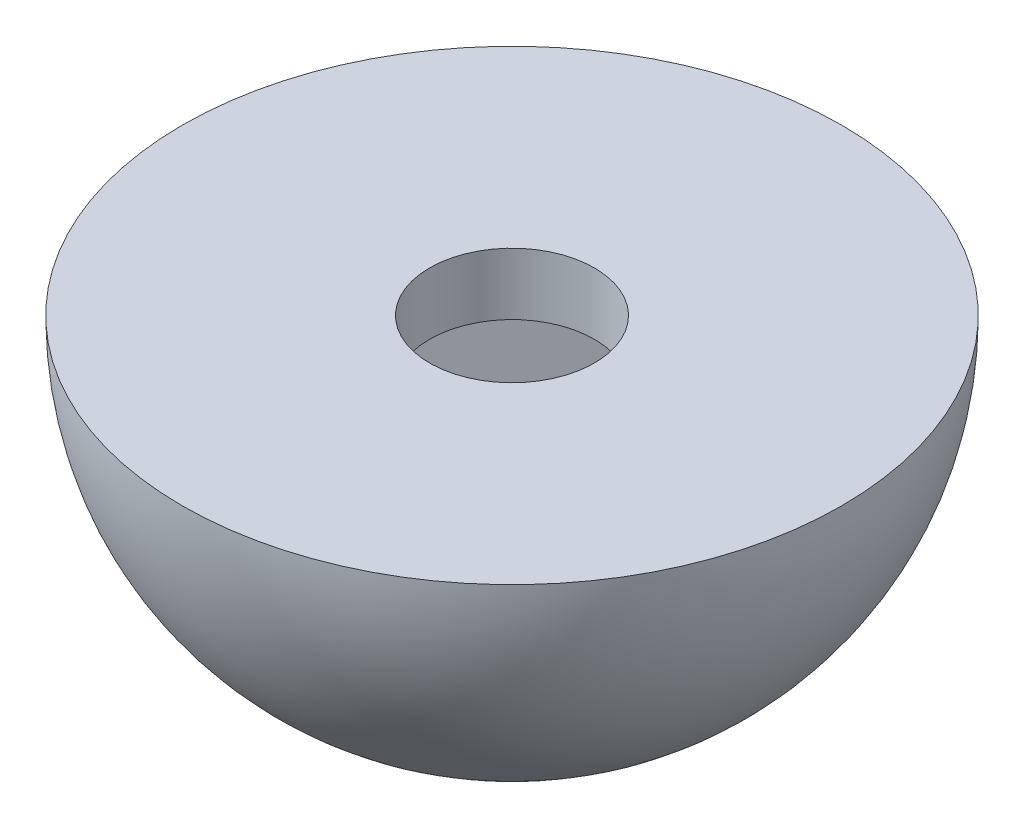
ISO-10303-21;
HEADER;
FILE_DESCRIPTION(('STEP AP214'),'2;1');
FILE_NAME('part.step','',(''),(''),'','','');
FILE_SCHEMA(('AUTOMOTIVE_DESIGN { 1 0 10303 214 1 1 1 1 }'));
ENDSEC;
DATA;
#1=APPLICATION_CONTEXT('core data for automotive mechanical design processes');
#2=APPLICATION_PROTOCOL_DEFINITION('international standard','automotive_design',2000,#1);
#3=PRODUCT_CONTEXT('',#1,'mechanical');
#4=PRODUCT('Part','Part','',(#3));
#5=PRODUCT_RELATED_PRODUCT_CATEGORY('part','',(#4));
#6=PRODUCT_DEFINITION_FORMATION('','',#4);
#7=PRODUCT_DEFINITION_CONTEXT('part definition',#1,'design');
#8=PRODUCT_DEFINITION('design','',#6,#7);
#9=PRODUCT_DEFINITION_SHAPE('','',#8);
#10=(LENGTH_UNIT() NAMED_UNIT(*) SI_UNIT(.MILLI.,.METRE.));
#11=(NAMED_UNIT(*) PLANE_ANGLE_UNIT() SI_UNIT($,.RADIAN.));
#12=(NAMED_UNIT(*) SI_UNIT($,.STERADIAN.) SOLID_ANGLE_UNIT());
#13=UNCERTAINTY_MEASURE_WITH_UNIT(LENGTH_MEASURE(1.E-05),#10,'distance_accuracy_value','');
#14=(GEOMETRIC_REPRESENTATION_CONTEXT(3) GLOBAL_UNCERTAINTY_ASSIGNED_CONTEXT((#13)) GLOBAL_UNIT_ASSIGNED_CONTEXT((#10,
#11,#12)) REPRESENTATION_CONTEXT('',''));
#15=CARTESIAN_POINT('',(0.,0.,0.));
#16=DIRECTION('',(0.,0.,1.));
#17=DIRECTION('',(1.,0.,0.));
#18=AXIS2_PLACEMENT_3D('',#15,#16,#17);
#19=CARTESIAN_POINT('',(0.,0.,0.));
#20=DIRECTION('',(0.,1.,0.));
#21=DIRECTION('',(-1.,0.,0.));
#22=AXIS2_PLACEMENT_3D('',#19,#20,#21);
#23=SPHERICAL_SURFACE('',#22,4.);
#24=CARTESIAN_POINT('',(1.25514625240658,0.,1.57996293787851));
#25=DIRECTION('',(0.622024915621709,0.,0.782997448492525));
#26=DIRECTION('',(0.782997448492526,0.,-0.62202491562171));
#27=AXIS2_PLACEMENT_3D('',#24,#25,#26);
#28=CIRCLE('',#27,3.45374072564806);
#29=CARTESIAN_POINT('',(2.16733827990038,-3.25132280771996,0.855303911179222));
#30=VERTEX_POINT('',#29);
#31=CARTESIAN_POINT('',(0.342954224912791,-3.25132280771996,2.30462196457781));
#32=VERTEX_POINT('',#31);
#33=EDGE_CURVE('E11',#30,#32,#28,.F.);
#34=ORIENTED_EDGE('',*,*,#33,.F.);
#35=CARTESIAN_POINT('',(1.99586116744398,0.,-0.29700707110968));
#36=DIRECTION('',(0.989108139303779,0.,-0.14719065446901));
#37=DIRECTION('',(-0.14719065446901,0.,-0.989108139303779));
#38=AXIS2_PLACEMENT_3D('',#35,#36,#37);
#39=CIRCLE('',#38,3.45374072564806);
#40=CARTESIAN_POINT('',(1.82438405498758,-3.25132280771996,-1.44931805339858));
#41=VERTEX_POINT('',#40);
#42=EDGE_CURVE('E86',#41,#30,#39,.F.);
#43=ORIENTED_EDGE('',*,*,#42,.F.);
#44=CARTESIAN_POINT('',(0.740714915037396,0.,-1.8769700089882));
#45=DIRECTION('',(0.36708322368207,0.,-0.930188102961535));
#46=DIRECTION('',(-0.930188102961535,0.,-0.36708322368207));
#47=AXIS2_PLACEMENT_3D('',#44,#45,#46);
#48=CIRCLE('',#47,3.45374072564806);
#49=CARTESIAN_POINT('',(-0.342954224912791,-3.25132280771996,-2.30462196457781));
#50=VERTEX_POINT('',#49);
#51=EDGE_CURVE('E131',#50,#41,#48,.F.);
#52=ORIENTED_EDGE('',*,*,#51,.F.);
#53=CARTESIAN_POINT('',(-1.25514625240658,0.,-1.57996293787851));
#54=DIRECTION('',(-0.622024915621709,0.,-0.782997448492526));
#55=DIRECTION('',(-0.782997448492526,0.,0.622024915621709));
#56=AXIS2_PLACEMENT_3D('',#53,#54,#55);
#57=CIRCLE('',#56,3.45374072564806);
#58=CARTESIAN_POINT('',(-2.16733827990038,-3.25132280771996,-0.855303911179223));
#59=VERTEX_POINT('',#58);
#60=EDGE_CURVE('E133',#59,#50,#57,.F.);
#61=ORIENTED_EDGE('',*,*,#60,.F.);
#62=CARTESIAN_POINT('',(-1.99586116744398,0.,0.29700707110968));
#63=DIRECTION('',(-0.989108139303779,0.,0.14719065446901));
#64=DIRECTION('',(0.14719065446901,0.,0.989108139303779));
#65=AXIS2_PLACEMENT_3D('',#62,#63,#64);
#66=CIRCLE('',#65,3.45374072564806);
#67=CARTESIAN_POINT('',(-1.82438405498758,-3.25132280771996,1.44931805339858));
#68=VERTEX_POINT('',#67);
#69=EDGE_CURVE('E135',#68,#59,#66,.F.);
#70=ORIENTED_EDGE('',*,*,#69,.F.);
#71=CARTESIAN_POINT('',(-0.740714915037396,0.,1.87697000898819));
#72=DIRECTION('',(-0.36708322368207,0.,0.930188102961535));
#73=DIRECTION('',(0.930188102961535,0.,0.36708322368207));
#74=AXIS2_PLACEMENT_3D('',#71,#72,#73);
#75=CIRCLE('',#74,3.45374072564806);
#76=EDGE_CURVE('E39',#32,#68,#75,.F.);
#77=ORIENTED_EDGE('',*,*,#76,.F.);
#78=EDGE_LOOP('',(#34,#43,#52,#61,#70,#77));
#79=FACE_BOUND('',#78,.T.);
#80=CARTESIAN_POINT('',(0.,0.,0.));
#81=DIRECTION('',(0.,1.,0.));
#82=DIRECTION('',(-1.,0.,0.));
#83=AXIS2_PLACEMENT_3D('',#80,#81,#82);
#84=CIRCLE('',#83,4.);
#85=CARTESIAN_POINT('',(-4.,0.,0.));
#86=VERTEX_POINT('',#85);
#87=EDGE_CURVE('E125',#86,#86,#84,.T.);
#88=ORIENTED_EDGE('',*,*,#87,.F.);
#89=EDGE_LOOP('',(#88));
#90=FACE_BOUND('',#89,.T.);
#91=ADVANCED_FACE('F32',(#79,#90),#23,.T.);
#92=CARTESIAN_POINT('',(-4.,0.,0.));
#93=DIRECTION('',(0.,1.,0.));
#94=DIRECTION('',(-1.,0.,0.));
#95=AXIS2_PLACEMENT_3D('',#92,#93,#94);
#96=PLANE('',#95);
#97=CARTESIAN_POINT('',(0.,0.,0.));
#98=DIRECTION('',(0.,1.,0.));
#99=DIRECTION('',(-1.,0.,0.));
#100=AXIS2_PLACEMENT_3D('',#97,#98,#99);
#101=CIRCLE('',#100,1.);
#102=CARTESIAN_POINT('',(-1.,0.,0.));
#103=VERTEX_POINT('',#102);
#104=EDGE_CURVE('E122',#103,#103,#101,.T.);
#105=ORIENTED_EDGE('',*,*,#104,.F.);
#106=EDGE_LOOP('',(#105));
#107=FACE_BOUND('',#106,.T.);
#108=ORIENTED_EDGE('',*,*,#87,.T.);
#109=EDGE_LOOP('',(#108));
#110=FACE_BOUND('',#109,.T.);
#111=ADVANCED_FACE('F163',(#107,#110),#96,.T.);
#112=CARTESIAN_POINT('',(0.,-4.,0.));
#113=DIRECTION('',(0.,1.,0.));
#114=DIRECTION('',(-1.,0.,0.));
#115=AXIS2_PLACEMENT_3D('',#112,#113,#114);
#116=CYLINDRICAL_SURFACE('',#115,1.);
#117=CARTESIAN_POINT('',(0.,-0.75,0.));
#118=DIRECTION('',(0.,1.,0.));
#119=DIRECTION('',(-1.,0.,0.));
#120=AXIS2_PLACEMENT_3D('',#117,#118,#119);
#121=CIRCLE('',#120,1.);
#122=CARTESIAN_POINT('',(-1.,-0.75,0.));
#123=VERTEX_POINT('',#122);
#124=EDGE_CURVE('E114',#123,#123,#121,.F.);
#125=ORIENTED_EDGE('',*,*,#124,.T.);
#126=EDGE_LOOP('',(#125));
#127=FACE_BOUND('',#126,.T.);
#128=ORIENTED_EDGE('',*,*,#104,.T.);
#129=EDGE_LOOP('',(#128));
#130=FACE_BOUND('',#129,.T.);
#131=ADVANCED_FACE('F167',(#127,#130),#116,.F.);
#132=CARTESIAN_POINT('',(0.,-0.75,0.));
#133=DIRECTION('',(0.,1.,0.));
#134=DIRECTION('',(-1.,0.,0.));
#135=AXIS2_PLACEMENT_3D('',#132,#133,#134);
#136=PLANE('',#135);
#137=DIRECTION('',(0.782997448492525,0.,-0.622024915621709));
#138=VECTOR('',#137,1.);
#139=CARTESIAN_POINT('',(0.342954224912791,-0.75,2.30462196457781));
#140=LINE('',#139,#138);
#141=CARTESIAN_POINT('',(0.342954224912791,-0.75,2.30462196457781));
#142=VERTEX_POINT('',#141);
#143=CARTESIAN_POINT('',(2.16733827990038,-0.75,0.855303911179223));
#144=VERTEX_POINT('',#143);
#145=EDGE_CURVE('E95',#142,#144,#140,.T.);
#146=ORIENTED_EDGE('',*,*,#145,.F.);
#147=DIRECTION('',(0.930188102961535,0.,0.36708322368207));
#148=VECTOR('',#147,1.);
#149=CARTESIAN_POINT('',(-1.82438405498759,-0.750000000000001,1.44931805339858));
#150=LINE('',#149,#148);
#151=CARTESIAN_POINT('',(-1.82438405498759,-0.750000000000001,1.44931805339858));
#152=VERTEX_POINT('',#151);
#153=EDGE_CURVE('E88',#152,#142,#150,.T.);
#154=ORIENTED_EDGE('',*,*,#153,.F.);
#155=DIRECTION('',(0.14719065446901,0.,0.989108139303779));
#156=VECTOR('',#155,1.);
#157=CARTESIAN_POINT('',(-2.16733827990038,-0.750000000000001,-0.855303911179223));
#158=LINE('',#157,#156);
#159=CARTESIAN_POINT('',(-2.16733827990038,-0.750000000000001,-0.855303911179223));
#160=VERTEX_POINT('',#159);
#161=EDGE_CURVE('E109',#160,#152,#158,.T.);
#162=ORIENTED_EDGE('',*,*,#161,.F.);
#163=DIRECTION('',(-0.782997448492526,0.,0.622024915621709));
#164=VECTOR('',#163,1.);
#165=CARTESIAN_POINT('',(-0.342954224912792,-0.75,-2.30462196457781));
#166=LINE('',#165,#164);
#167=CARTESIAN_POINT('',(-0.342954224912792,-0.75,-2.30462196457781));
#168=VERTEX_POINT('',#167);
#169=EDGE_CURVE('E106',#168,#160,#166,.T.);
#170=ORIENTED_EDGE('',*,*,#169,.F.);
#171=DIRECTION('',(-0.930188102961535,0.,-0.36708322368207));
#172=VECTOR('',#171,1.);
#173=CARTESIAN_POINT('',(1.82438405498758,-0.75,-1.44931805339858));
#174=LINE('',#173,#172);
#175=CARTESIAN_POINT('',(1.82438405498758,-0.75,-1.44931805339858));
#176=VERTEX_POINT('',#175);
#177=EDGE_CURVE('E98',#176,#168,#174,.T.);
#178=ORIENTED_EDGE('',*,*,#177,.F.);
#179=DIRECTION('',(-0.14719065446901,0.,-0.989108139303779));
#180=VECTOR('',#179,1.);
#181=CARTESIAN_POINT('',(2.16733827990038,-0.75,0.855303911179223));
#182=LINE('',#181,#180);
#183=EDGE_CURVE('E83',#144,#176,#182,.T.);
#184=ORIENTED_EDGE('',*,*,#183,.F.);
#185=EDGE_LOOP('',(#146,#154,#162,#170,#178,#184));
#186=FACE_BOUND('',#185,.T.);
#187=ORIENTED_EDGE('',*,*,#124,.F.);
#188=EDGE_LOOP('',(#187));
#189=FACE_BOUND('',#188,.T.);
#190=ADVANCED_FACE('F92',(#186,#189),#136,.F.);
#191=CARTESIAN_POINT('',(0.342954224912792,-3.87298334620742,2.30462196457781));
#192=DIRECTION('',(0.622024915621709,0.,0.782997448492525));
#193=DIRECTION('',(0.782997448492526,0.,-0.62202491562171));
#194=AXIS2_PLACEMENT_3D('',#191,#192,#193);
#195=PLANE('',#194);
#196=ORIENTED_EDGE('',*,*,#33,.T.);
#197=DIRECTION('',(0.,1.,0.));
#198=VECTOR('',#197,1.);
#199=CARTESIAN_POINT('',(0.342954224912792,-3.87298334620742,2.30462196457781));
#200=LINE('',#199,#198);
#201=EDGE_CURVE('E101',#32,#142,#200,.T.);
#202=ORIENTED_EDGE('',*,*,#201,.T.);
#203=ORIENTED_EDGE('',*,*,#145,.T.);
#204=DIRECTION('',(0.,1.,0.));
#205=VECTOR('',#204,1.);
#206=CARTESIAN_POINT('',(2.16733827990038,-3.87298334620742,0.855303911179223));
#207=LINE('',#206,#205);
#208=EDGE_CURVE('E80',#30,#144,#207,.T.);
#209=ORIENTED_EDGE('',*,*,#208,.F.);
#210=EDGE_LOOP('',(#196,#202,#203,#209));
#211=FACE_BOUND('',#210,.T.);
#212=ADVANCED_FACE('F100',(#211),#195,.F.);
#213=CARTESIAN_POINT('',(-1.82438405498758,-3.87298334620742,1.44931805339858));
#214=DIRECTION('',(-0.36708322368207,0.,0.930188102961535));
#215=DIRECTION('',(0.930188102961535,0.,0.36708322368207));
#216=AXIS2_PLACEMENT_3D('',#213,#214,#215);
#217=PLANE('',#216);
#218=ORIENTED_EDGE('',*,*,#76,.T.);
#219=DIRECTION('',(0.,1.,0.));
#220=VECTOR('',#219,1.);
#221=CARTESIAN_POINT('',(-1.82438405498758,-3.87298334620742,1.44931805339858));
#222=LINE('',#221,#220);
#223=EDGE_CURVE('E115',#68,#152,#222,.T.);
#224=ORIENTED_EDGE('',*,*,#223,.T.);
#225=ORIENTED_EDGE('',*,*,#153,.T.);
#226=ORIENTED_EDGE('',*,*,#201,.F.);
#227=EDGE_LOOP('',(#218,#224,#225,#226));
#228=FACE_BOUND('',#227,.T.);
#229=ADVANCED_FACE('F139',(#228),#217,.F.);
#230=CARTESIAN_POINT('',(-2.16733827990038,-3.87298334620742,-0.855303911179223));
#231=DIRECTION('',(-0.989108139303779,0.,0.14719065446901));
#232=DIRECTION('',(0.14719065446901,0.,0.989108139303779));
#233=AXIS2_PLACEMENT_3D('',#230,#231,#232);
#234=PLANE('',#233);
#235=ORIENTED_EDGE('',*,*,#69,.T.);
#236=DIRECTION('',(0.,1.,0.));
#237=VECTOR('',#236,1.);
#238=CARTESIAN_POINT('',(-2.16733827990038,-3.87298334620742,-0.855303911179223));
#239=LINE('',#238,#237);
#240=EDGE_CURVE('E117',#59,#160,#239,.T.);
#241=ORIENTED_EDGE('',*,*,#240,.T.);
#242=ORIENTED_EDGE('',*,*,#161,.T.);
#243=ORIENTED_EDGE('',*,*,#223,.F.);
#244=EDGE_LOOP('',(#235,#241,#242,#243));
#245=FACE_BOUND('',#244,.T.);
#246=ADVANCED_FACE('F143',(#245),#234,.F.);
#247=CARTESIAN_POINT('',(-0.342954224912792,-3.87298334620742,-2.30462196457781));
#248=DIRECTION('',(-0.622024915621709,0.,-0.782997448492526));
#249=DIRECTION('',(-0.782997448492526,0.,0.622024915621709));
#250=AXIS2_PLACEMENT_3D('',#247,#248,#249);
#251=PLANE('',#250);
#252=ORIENTED_EDGE('',*,*,#60,.T.);
#253=DIRECTION('',(0.,1.,0.));
#254=VECTOR('',#253,1.);
#255=CARTESIAN_POINT('',(-0.342954224912792,-3.87298334620742,-2.30462196457781));
#256=LINE('',#255,#254);
#257=EDGE_CURVE('E119',#50,#168,#256,.T.);
#258=ORIENTED_EDGE('',*,*,#257,.T.);
#259=ORIENTED_EDGE('',*,*,#169,.T.);
#260=ORIENTED_EDGE('',*,*,#240,.F.);
#261=EDGE_LOOP('',(#252,#258,#259,#260));
#262=FACE_BOUND('',#261,.T.);
#263=ADVANCED_FACE('F151',(#262),#251,.F.);
#264=CARTESIAN_POINT('',(1.82438405498758,-3.87298334620742,-1.44931805339858));
#265=DIRECTION('',(0.36708322368207,0.,-0.930188102961535));
#266=DIRECTION('',(-0.930188102961535,0.,-0.36708322368207));
#267=AXIS2_PLACEMENT_3D('',#264,#265,#266);
#268=PLANE('',#267);
#269=ORIENTED_EDGE('',*,*,#51,.T.);
#270=DIRECTION('',(0.,1.,0.));
#271=VECTOR('',#270,1.);
#272=CARTESIAN_POINT('',(1.82438405498758,-3.87298334620742,-1.44931805339858));
#273=LINE('',#272,#271);
#274=EDGE_CURVE('E46',#41,#176,#273,.T.);
#275=ORIENTED_EDGE('',*,*,#274,.T.);
#276=ORIENTED_EDGE('',*,*,#177,.T.);
#277=ORIENTED_EDGE('',*,*,#257,.F.);
#278=EDGE_LOOP('',(#269,#275,#276,#277));
#279=FACE_BOUND('',#278,.T.);
#280=ADVANCED_FACE('F153',(#279),#268,.F.);
#281=CARTESIAN_POINT('',(2.16733827990038,-3.87298334620742,0.855303911179223));
#282=DIRECTION('',(0.989108139303779,0.,-0.14719065446901));
#283=DIRECTION('',(-0.14719065446901,0.,-0.989108139303779));
#284=AXIS2_PLACEMENT_3D('',#281,#282,#283);
#285=PLANE('',#284);
#286=ORIENTED_EDGE('',*,*,#42,.T.);
#287=ORIENTED_EDGE('',*,*,#208,.T.);
#288=ORIENTED_EDGE('',*,*,#183,.T.);
#289=ORIENTED_EDGE('',*,*,#274,.F.);
#290=EDGE_LOOP('',(#286,#287,#288,#289));
#291=FACE_BOUND('',#290,.T.);
#292=ADVANCED_FACE('F82',(#291),#285,.F.);
#293=CLOSED_SHELL('',(#91,#111,#131,#190,#212,#229,#246,#263,#280,#292));
#294=MANIFOLD_SOLID_BREP('B2',#293);
#295=ADVANCED_BREP_SHAPE_REPRESENTATION('',(#18,#294),#14);
#296=SHAPE_DEFINITION_REPRESENTATION(#9,#295);
ENDSEC;
END-ISO-10303-21;
